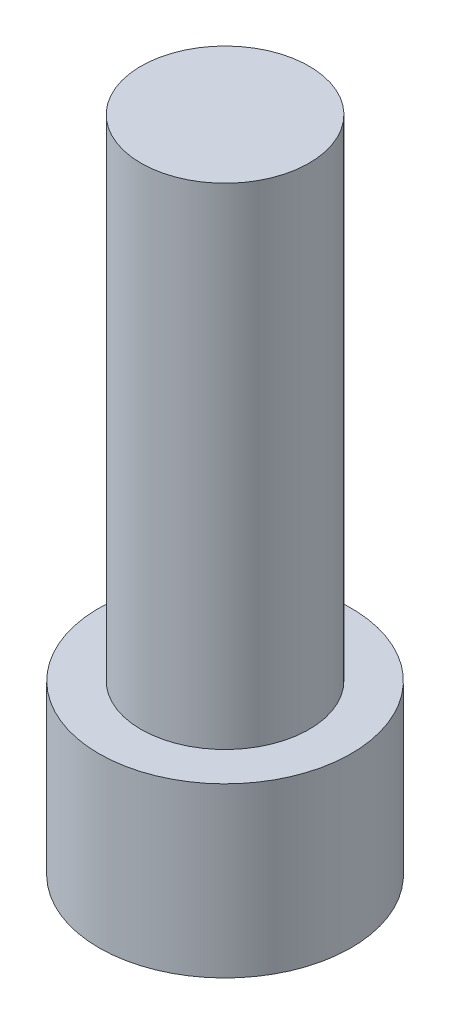
ISO-10303-21;
HEADER;
FILE_DESCRIPTION(('STEP AP214'),'2;1');
FILE_NAME('part.step','',(''),(''),'','','');
FILE_SCHEMA(('AUTOMOTIVE_DESIGN { 1 0 10303 214 1 1 1 1 }'));
ENDSEC;
DATA;
#1=APPLICATION_CONTEXT('core data for automotive mechanical design processes');
#2=APPLICATION_PROTOCOL_DEFINITION('international standard','automotive_design',2000,#1);
#3=PRODUCT_CONTEXT('',#1,'mechanical');
#4=PRODUCT('Part','Part','',(#3));
#5=PRODUCT_RELATED_PRODUCT_CATEGORY('part','',(#4));
#6=PRODUCT_DEFINITION_FORMATION('','',#4);
#7=PRODUCT_DEFINITION_CONTEXT('part definition',#1,'design');
#8=PRODUCT_DEFINITION('design','',#6,#7);
#9=PRODUCT_DEFINITION_SHAPE('','',#8);
#10=(LENGTH_UNIT() NAMED_UNIT(*) SI_UNIT(.MILLI.,.METRE.));
#11=(NAMED_UNIT(*) PLANE_ANGLE_UNIT() SI_UNIT($,.RADIAN.));
#12=(NAMED_UNIT(*) SI_UNIT($,.STERADIAN.) SOLID_ANGLE_UNIT());
#13=UNCERTAINTY_MEASURE_WITH_UNIT(LENGTH_MEASURE(1.E-05),#10,'distance_accuracy_value','');
#14=(GEOMETRIC_REPRESENTATION_CONTEXT(3) GLOBAL_UNCERTAINTY_ASSIGNED_CONTEXT((#13)) GLOBAL_UNIT_ASSIGNED_CONTEXT((#10,
#11,#12)) REPRESENTATION_CONTEXT('',''));
#15=CARTESIAN_POINT('',(0.,0.,0.));
#16=DIRECTION('',(0.,0.,1.));
#17=DIRECTION('',(1.,0.,0.));
#18=AXIS2_PLACEMENT_3D('',#15,#16,#17);
#19=CARTESIAN_POINT('',(0.,12.,0.));
#20=DIRECTION('',(0.,1.,0.));
#21=DIRECTION('',(0.,0.,1.));
#22=AXIS2_PLACEMENT_3D('',#19,#20,#21);
#23=PLANE('',#22);
#24=CARTESIAN_POINT('',(0.,12.,0.));
#25=DIRECTION('',(0.,1.,0.));
#26=DIRECTION('',(0.,0.,1.));
#27=AXIS2_PLACEMENT_3D('',#24,#25,#26);
#28=CIRCLE('',#27,9.);
#29=CARTESIAN_POINT('',(0.,12.,9.));
#30=VERTEX_POINT('',#29);
#31=EDGE_CURVE('E10',#30,#30,#28,.T.);
#32=ORIENTED_EDGE('',*,*,#31,.T.);
#33=EDGE_LOOP('',(#32));
#34=FACE_BOUND('',#33,.T.);
#35=CARTESIAN_POINT('',(0.,12.,0.));
#36=DIRECTION('',(0.,1.,0.));
#37=DIRECTION('',(0.,0.,1.));
#38=AXIS2_PLACEMENT_3D('',#35,#36,#37);
#39=CIRCLE('',#38,6.);
#40=CARTESIAN_POINT('',(0.,12.,6.));
#41=VERTEX_POINT('',#40);
#42=EDGE_CURVE('E42',#41,#41,#39,.T.);
#43=ORIENTED_EDGE('',*,*,#42,.F.);
#44=EDGE_LOOP('',(#43));
#45=FACE_BOUND('',#44,.T.);
#46=ADVANCED_FACE('F29',(#34,#45),#23,.T.);
#47=CARTESIAN_POINT('',(0.,12.,0.));
#48=DIRECTION('',(0.,-1.,0.));
#49=DIRECTION('',(0.,0.,-1.));
#50=AXIS2_PLACEMENT_3D('',#47,#48,#49);
#51=CYLINDRICAL_SURFACE('',#50,9.);
#52=ORIENTED_EDGE('',*,*,#31,.F.);
#53=EDGE_LOOP('',(#52));
#54=FACE_BOUND('',#53,.T.);
#55=CARTESIAN_POINT('',(0.,0.,0.));
#56=DIRECTION('',(0.,1.,0.));
#57=DIRECTION('',(0.,0.,1.));
#58=AXIS2_PLACEMENT_3D('',#55,#56,#57);
#59=CIRCLE('',#58,9.);
#60=CARTESIAN_POINT('',(0.,0.,9.));
#61=VERTEX_POINT('',#60);
#62=EDGE_CURVE('E33',#61,#61,#59,.T.);
#63=ORIENTED_EDGE('',*,*,#62,.T.);
#64=EDGE_LOOP('',(#63));
#65=FACE_BOUND('',#64,.T.);
#66=ADVANCED_FACE('F31',(#54,#65),#51,.T.);
#67=CARTESIAN_POINT('',(0.,0.,0.));
#68=DIRECTION('',(0.,1.,0.));
#69=DIRECTION('',(0.,0.,1.));
#70=AXIS2_PLACEMENT_3D('',#67,#68,#69);
#71=PLANE('',#70);
#72=ORIENTED_EDGE('',*,*,#62,.F.);
#73=EDGE_LOOP('',(#72));
#74=FACE_BOUND('',#73,.T.);
#75=ADVANCED_FACE('F53',(#74),#71,.F.);
#76=CARTESIAN_POINT('',(0.,47.,0.));
#77=DIRECTION('',(0.,-1.,0.));
#78=DIRECTION('',(0.,0.,-1.));
#79=AXIS2_PLACEMENT_3D('',#76,#77,#78);
#80=CYLINDRICAL_SURFACE('',#79,6.);
#81=CARTESIAN_POINT('',(0.,47.,0.));
#82=DIRECTION('',(0.,1.,0.));
#83=DIRECTION('',(0.,0.,1.));
#84=AXIS2_PLACEMENT_3D('',#81,#82,#83);
#85=CIRCLE('',#84,6.);
#86=CARTESIAN_POINT('',(0.,47.,6.));
#87=VERTEX_POINT('',#86);
#88=EDGE_CURVE('E40',#87,#87,#85,.T.);
#89=ORIENTED_EDGE('',*,*,#88,.F.);
#90=EDGE_LOOP('',(#89));
#91=FACE_BOUND('',#90,.T.);
#92=ORIENTED_EDGE('',*,*,#42,.T.);
#93=EDGE_LOOP('',(#92));
#94=FACE_BOUND('',#93,.T.);
#95=ADVANCED_FACE('F50',(#91,#94),#80,.T.);
#96=CARTESIAN_POINT('',(0.,47.,0.));
#97=DIRECTION('',(0.,1.,0.));
#98=DIRECTION('',(0.,0.,1.));
#99=AXIS2_PLACEMENT_3D('',#96,#97,#98);
#100=PLANE('',#99);
#101=ORIENTED_EDGE('',*,*,#88,.T.);
#102=EDGE_LOOP('',(#101));
#103=FACE_BOUND('',#102,.T.);
#104=ADVANCED_FACE('F48',(#103),#100,.T.);
#105=CLOSED_SHELL('',(#46,#66,#75,#95,#104));
#106=MANIFOLD_SOLID_BREP('B2',#105);
#107=ADVANCED_BREP_SHAPE_REPRESENTATION('',(#18,#106),#14);
#108=SHAPE_DEFINITION_REPRESENTATION(#9,#107);
ENDSEC;
END-ISO-10303-21;
